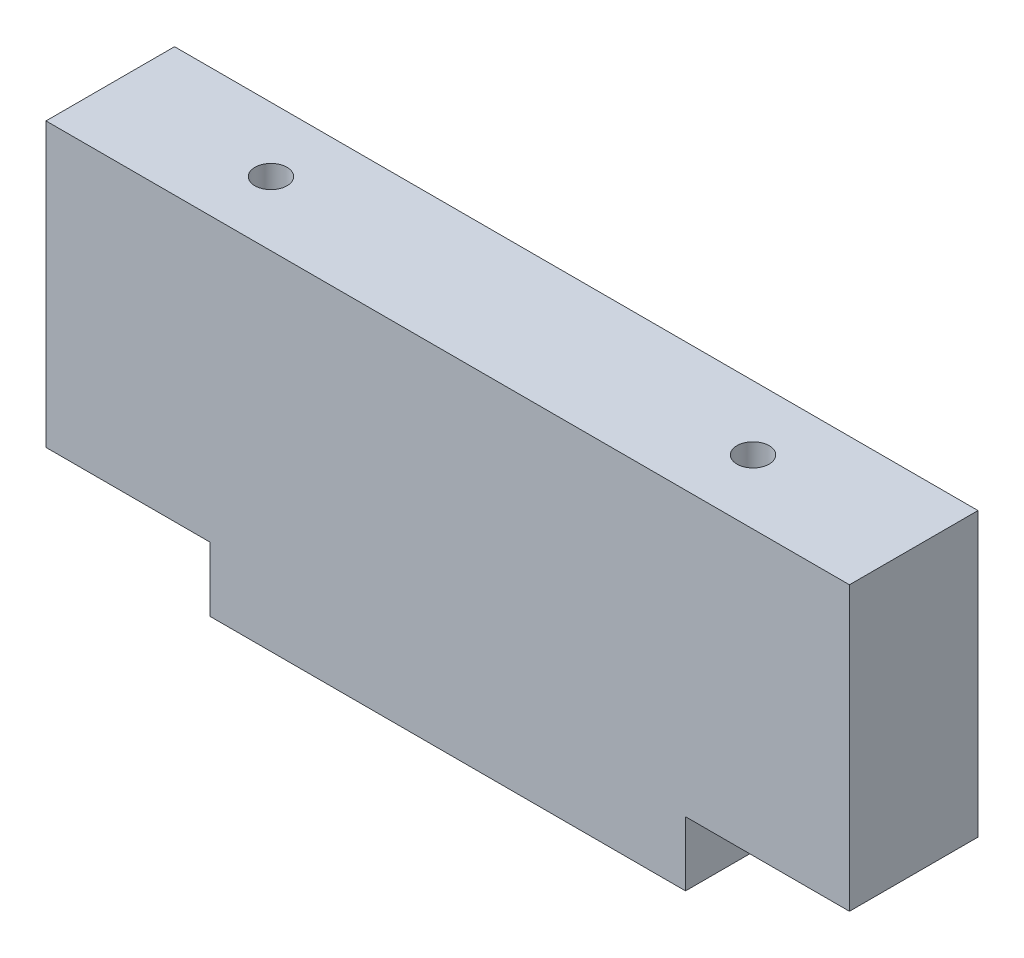
ISO-10303-21;
HEADER;
FILE_DESCRIPTION(('STEP AP214'),'2;1');
FILE_NAME('part.step','',(''),(''),'','','');
FILE_SCHEMA(('AUTOMOTIVE_DESIGN { 1 0 10303 214 1 1 1 1 }'));
ENDSEC;
DATA;
#1=APPLICATION_CONTEXT('core data for automotive mechanical design processes');
#2=APPLICATION_PROTOCOL_DEFINITION('international standard','automotive_design',2000,#1);
#3=PRODUCT_CONTEXT('',#1,'mechanical');
#4=PRODUCT('Part','Part','',(#3));
#5=PRODUCT_RELATED_PRODUCT_CATEGORY('part','',(#4));
#6=PRODUCT_DEFINITION_FORMATION('','',#4);
#7=PRODUCT_DEFINITION_CONTEXT('part definition',#1,'design');
#8=PRODUCT_DEFINITION('design','',#6,#7);
#9=PRODUCT_DEFINITION_SHAPE('','',#8);
#10=(LENGTH_UNIT() NAMED_UNIT(*) SI_UNIT(.MILLI.,.METRE.));
#11=(NAMED_UNIT(*) PLANE_ANGLE_UNIT() SI_UNIT($,.RADIAN.));
#12=(NAMED_UNIT(*) SI_UNIT($,.STERADIAN.) SOLID_ANGLE_UNIT());
#13=UNCERTAINTY_MEASURE_WITH_UNIT(LENGTH_MEASURE(1.E-05),#10,'distance_accuracy_value','');
#14=(GEOMETRIC_REPRESENTATION_CONTEXT(3) GLOBAL_UNCERTAINTY_ASSIGNED_CONTEXT((#13)) GLOBAL_UNIT_ASSIGNED_CONTEXT((#10,
#11,#12)) REPRESENTATION_CONTEXT('',''));
#15=CARTESIAN_POINT('',(0.,0.,0.));
#16=DIRECTION('',(0.,0.,1.));
#17=DIRECTION('',(1.,0.,0.));
#18=AXIS2_PLACEMENT_3D('',#15,#16,#17);
#19=CARTESIAN_POINT('',(-37.,10.,10.));
#20=DIRECTION('',(1.,0.,0.));
#21=DIRECTION('',(0.,0.,-1.));
#22=AXIS2_PLACEMENT_3D('',#19,#20,#21);
#23=PLANE('',#22);
#24=DIRECTION('',(0.,-1.,0.));
#25=VECTOR('',#24,1.);
#26=CARTESIAN_POINT('',(-37.,10.,-10.));
#27=LINE('',#26,#25);
#28=CARTESIAN_POINT('',(-37.,10.,-10.));
#29=VERTEX_POINT('',#28);
#30=CARTESIAN_POINT('',(-37.,0.,-10.));
#31=VERTEX_POINT('',#30);
#32=EDGE_CURVE('E136',#29,#31,#27,.T.);
#33=ORIENTED_EDGE('',*,*,#32,.T.);
#34=DIRECTION('',(0.,0.,-1.));
#35=VECTOR('',#34,1.);
#36=CARTESIAN_POINT('',(-37.,0.,10.));
#37=LINE('',#36,#35);
#38=CARTESIAN_POINT('',(-37.,0.,10.));
#39=VERTEX_POINT('',#38);
#40=EDGE_CURVE('E11',#39,#31,#37,.T.);
#41=ORIENTED_EDGE('',*,*,#40,.F.);
#42=DIRECTION('',(0.,-1.,0.));
#43=VECTOR('',#42,1.);
#44=CARTESIAN_POINT('',(-37.,10.,10.));
#45=LINE('',#44,#43);
#46=CARTESIAN_POINT('',(-37.,10.,10.));
#47=VERTEX_POINT('',#46);
#48=EDGE_CURVE('E151',#47,#39,#45,.T.);
#49=ORIENTED_EDGE('',*,*,#48,.F.);
#50=DIRECTION('',(0.,0.,-1.));
#51=VECTOR('',#50,1.);
#52=CARTESIAN_POINT('',(-37.,10.,10.));
#53=LINE('',#52,#51);
#54=EDGE_CURVE('E132',#47,#29,#53,.T.);
#55=ORIENTED_EDGE('',*,*,#54,.T.);
#56=EDGE_LOOP('',(#33,#41,#49,#55));
#57=FACE_BOUND('',#56,.T.);
#58=ADVANCED_FACE('F37',(#57),#23,.F.);
#59=CARTESIAN_POINT('',(-37.,0.,10.));
#60=DIRECTION('',(0.,1.,0.));
#61=DIRECTION('',(0.,0.,1.));
#62=AXIS2_PLACEMENT_3D('',#59,#60,#61);
#63=PLANE('',#62);
#64=DIRECTION('',(1.,0.,0.));
#65=VECTOR('',#64,1.);
#66=CARTESIAN_POINT('',(-37.,0.,-10.));
#67=LINE('',#66,#65);
#68=CARTESIAN_POINT('',(37.,0.,-10.));
#69=VERTEX_POINT('',#68);
#70=EDGE_CURVE('E139',#31,#69,#67,.T.);
#71=ORIENTED_EDGE('',*,*,#70,.T.);
#72=DIRECTION('',(0.,0.,-1.));
#73=VECTOR('',#72,1.);
#74=CARTESIAN_POINT('',(37.,0.,10.));
#75=LINE('',#74,#73);
#76=CARTESIAN_POINT('',(37.,0.,10.));
#77=VERTEX_POINT('',#76);
#78=EDGE_CURVE('E45',#77,#69,#75,.T.);
#79=ORIENTED_EDGE('',*,*,#78,.F.);
#80=DIRECTION('',(1.,0.,0.));
#81=VECTOR('',#80,1.);
#82=CARTESIAN_POINT('',(-37.,0.,10.));
#83=LINE('',#82,#81);
#84=EDGE_CURVE('E97',#39,#77,#83,.T.);
#85=ORIENTED_EDGE('',*,*,#84,.F.);
#86=ORIENTED_EDGE('',*,*,#40,.T.);
#87=EDGE_LOOP('',(#71,#79,#85,#86));
#88=FACE_BOUND('',#87,.T.);
#89=ADVANCED_FACE('F232',(#88),#63,.F.);
#90=CARTESIAN_POINT('',(37.,0.,10.));
#91=DIRECTION('',(-1.,0.,0.));
#92=DIRECTION('',(0.,0.,1.));
#93=AXIS2_PLACEMENT_3D('',#90,#91,#92);
#94=PLANE('',#93);
#95=DIRECTION('',(0.,1.,0.));
#96=VECTOR('',#95,1.);
#97=CARTESIAN_POINT('',(37.,0.,-10.));
#98=LINE('',#97,#96);
#99=CARTESIAN_POINT('',(37.,10.,-10.));
#100=VERTEX_POINT('',#99);
#101=EDGE_CURVE('E142',#69,#100,#98,.T.);
#102=ORIENTED_EDGE('',*,*,#101,.T.);
#103=DIRECTION('',(0.,0.,-1.));
#104=VECTOR('',#103,1.);
#105=CARTESIAN_POINT('',(37.,10.,10.));
#106=LINE('',#105,#104);
#107=CARTESIAN_POINT('',(37.,10.,10.));
#108=VERTEX_POINT('',#107);
#109=EDGE_CURVE('E158',#108,#100,#106,.T.);
#110=ORIENTED_EDGE('',*,*,#109,.F.);
#111=DIRECTION('',(0.,1.,0.));
#112=VECTOR('',#111,1.);
#113=CARTESIAN_POINT('',(37.,0.,10.));
#114=LINE('',#113,#112);
#115=EDGE_CURVE('E166',#77,#108,#114,.T.);
#116=ORIENTED_EDGE('',*,*,#115,.F.);
#117=ORIENTED_EDGE('',*,*,#78,.T.);
#118=EDGE_LOOP('',(#102,#110,#116,#117));
#119=FACE_BOUND('',#118,.T.);
#120=ADVANCED_FACE('F164',(#119),#94,.F.);
#121=CARTESIAN_POINT('',(37.,10.,10.));
#122=DIRECTION('',(0.,1.,0.));
#123=DIRECTION('',(-1.,0.,0.));
#124=AXIS2_PLACEMENT_3D('',#121,#122,#123);
#125=PLANE('',#124);
#126=CARTESIAN_POINT('',(50.,10.,0.));
#127=DIRECTION('',(0.,-1.,0.));
#128=DIRECTION('',(0.,0.,-1.));
#129=AXIS2_PLACEMENT_3D('',#126,#127,#128);
#130=CIRCLE('',#129,2.49999999999999);
#131=CARTESIAN_POINT('',(50.,10.,-2.49999999999999));
#132=VERTEX_POINT('',#131);
#133=EDGE_CURVE('E186',#132,#132,#130,.T.);
#134=ORIENTED_EDGE('',*,*,#133,.F.);
#135=EDGE_LOOP('',(#134));
#136=FACE_BOUND('',#135,.T.);
#137=DIRECTION('',(1.,0.,0.));
#138=VECTOR('',#137,1.);
#139=CARTESIAN_POINT('',(37.,10.,-10.));
#140=LINE('',#139,#138);
#141=CARTESIAN_POINT('',(62.5,10.,-10.));
#142=VERTEX_POINT('',#141);
#143=EDGE_CURVE('E144',#100,#142,#140,.T.);
#144=ORIENTED_EDGE('',*,*,#143,.T.);
#145=DIRECTION('',(0.,0.,-1.));
#146=VECTOR('',#145,1.);
#147=CARTESIAN_POINT('',(62.5,10.,10.));
#148=LINE('',#147,#146);
#149=CARTESIAN_POINT('',(62.5,10.,10.));
#150=VERTEX_POINT('',#149);
#151=EDGE_CURVE('E155',#150,#142,#148,.T.);
#152=ORIENTED_EDGE('',*,*,#151,.F.);
#153=DIRECTION('',(1.,0.,0.));
#154=VECTOR('',#153,1.);
#155=CARTESIAN_POINT('',(37.,10.,10.));
#156=LINE('',#155,#154);
#157=EDGE_CURVE('E178',#108,#150,#156,.T.);
#158=ORIENTED_EDGE('',*,*,#157,.F.);
#159=ORIENTED_EDGE('',*,*,#109,.T.);
#160=EDGE_LOOP('',(#144,#152,#158,#159));
#161=FACE_BOUND('',#160,.T.);
#162=ADVANCED_FACE('F174',(#136,#161),#125,.F.);
#163=CARTESIAN_POINT('',(62.5,10.,10.));
#164=DIRECTION('',(-1.,0.,0.));
#165=DIRECTION('',(0.,0.,1.));
#166=AXIS2_PLACEMENT_3D('',#163,#164,#165);
#167=PLANE('',#166);
#168=DIRECTION('',(0.,1.,0.));
#169=VECTOR('',#168,1.);
#170=CARTESIAN_POINT('',(62.5,10.,-10.));
#171=LINE('',#170,#169);
#172=CARTESIAN_POINT('',(62.5,54.,-10.));
#173=VERTEX_POINT('',#172);
#174=EDGE_CURVE('E146',#142,#173,#171,.T.);
#175=ORIENTED_EDGE('',*,*,#174,.T.);
#176=DIRECTION('',(0.,0.,-1.));
#177=VECTOR('',#176,1.);
#178=CARTESIAN_POINT('',(62.5,54.,10.));
#179=LINE('',#178,#177);
#180=CARTESIAN_POINT('',(62.5,54.,10.));
#181=VERTEX_POINT('',#180);
#182=EDGE_CURVE('E127',#181,#173,#179,.T.);
#183=ORIENTED_EDGE('',*,*,#182,.F.);
#184=DIRECTION('',(0.,1.,0.));
#185=VECTOR('',#184,1.);
#186=CARTESIAN_POINT('',(62.5,10.,10.));
#187=LINE('',#186,#185);
#188=EDGE_CURVE('E118',#150,#181,#187,.T.);
#189=ORIENTED_EDGE('',*,*,#188,.F.);
#190=ORIENTED_EDGE('',*,*,#151,.T.);
#191=EDGE_LOOP('',(#175,#183,#189,#190));
#192=FACE_BOUND('',#191,.T.);
#193=ADVANCED_FACE('F177',(#192),#167,.F.);
#194=CARTESIAN_POINT('',(62.5,54.,10.));
#195=DIRECTION('',(0.,-1.,0.));
#196=DIRECTION('',(1.,0.,0.));
#197=AXIS2_PLACEMENT_3D('',#194,#195,#196);
#198=PLANE('',#197);
#199=CARTESIAN_POINT('',(-37.5,54.,0.));
#200=DIRECTION('',(0.,1.,0.));
#201=DIRECTION('',(0.,0.,1.));
#202=AXIS2_PLACEMENT_3D('',#199,#200,#201);
#203=CIRCLE('',#202,2.49999999999999);
#204=CARTESIAN_POINT('',(-37.5,54.,2.49999999999999));
#205=VERTEX_POINT('',#204);
#206=EDGE_CURVE('E204',#205,#205,#203,.T.);
#207=ORIENTED_EDGE('',*,*,#206,.F.);
#208=EDGE_LOOP('',(#207));
#209=FACE_BOUND('',#208,.T.);
#210=CARTESIAN_POINT('',(37.5,54.,0.));
#211=DIRECTION('',(0.,1.,0.));
#212=DIRECTION('',(0.,0.,1.));
#213=AXIS2_PLACEMENT_3D('',#210,#211,#212);
#214=CIRCLE('',#213,2.49999999999999);
#215=CARTESIAN_POINT('',(37.5,54.,2.49999999999999));
#216=VERTEX_POINT('',#215);
#217=EDGE_CURVE('E198',#216,#216,#214,.T.);
#218=ORIENTED_EDGE('',*,*,#217,.F.);
#219=EDGE_LOOP('',(#218));
#220=FACE_BOUND('',#219,.T.);
#221=DIRECTION('',(-1.,0.,0.));
#222=VECTOR('',#221,1.);
#223=CARTESIAN_POINT('',(62.5,54.,-10.));
#224=LINE('',#223,#222);
#225=CARTESIAN_POINT('',(-62.5,54.,-10.));
#226=VERTEX_POINT('',#225);
#227=EDGE_CURVE('E126',#173,#226,#224,.T.);
#228=ORIENTED_EDGE('',*,*,#227,.T.);
#229=DIRECTION('',(0.,0.,-1.));
#230=VECTOR('',#229,1.);
#231=CARTESIAN_POINT('',(-62.5,54.,10.));
#232=LINE('',#231,#230);
#233=CARTESIAN_POINT('',(-62.5,54.,10.));
#234=VERTEX_POINT('',#233);
#235=EDGE_CURVE('E123',#234,#226,#232,.T.);
#236=ORIENTED_EDGE('',*,*,#235,.F.);
#237=DIRECTION('',(-1.,0.,0.));
#238=VECTOR('',#237,1.);
#239=CARTESIAN_POINT('',(62.5,54.,10.));
#240=LINE('',#239,#238);
#241=EDGE_CURVE('E112',#181,#234,#240,.T.);
#242=ORIENTED_EDGE('',*,*,#241,.F.);
#243=ORIENTED_EDGE('',*,*,#182,.T.);
#244=EDGE_LOOP('',(#228,#236,#242,#243));
#245=FACE_BOUND('',#244,.T.);
#246=ADVANCED_FACE('F124',(#209,#220,#245),#198,.F.);
#247=CARTESIAN_POINT('',(-62.5,54.,10.));
#248=DIRECTION('',(1.,0.,0.));
#249=DIRECTION('',(0.,1.,0.));
#250=AXIS2_PLACEMENT_3D('',#247,#248,#249);
#251=PLANE('',#250);
#252=DIRECTION('',(0.,-1.,0.));
#253=VECTOR('',#252,1.);
#254=CARTESIAN_POINT('',(-62.5,54.,-10.));
#255=LINE('',#254,#253);
#256=CARTESIAN_POINT('',(-62.5,10.,-10.));
#257=VERTEX_POINT('',#256);
#258=EDGE_CURVE('E83',#226,#257,#255,.T.);
#259=ORIENTED_EDGE('',*,*,#258,.T.);
#260=DIRECTION('',(0.,0.,-1.));
#261=VECTOR('',#260,1.);
#262=CARTESIAN_POINT('',(-62.5,10.,10.));
#263=LINE('',#262,#261);
#264=CARTESIAN_POINT('',(-62.5,10.,10.));
#265=VERTEX_POINT('',#264);
#266=EDGE_CURVE('E128',#265,#257,#263,.T.);
#267=ORIENTED_EDGE('',*,*,#266,.F.);
#268=DIRECTION('',(0.,-1.,0.));
#269=VECTOR('',#268,1.);
#270=CARTESIAN_POINT('',(-62.5,54.,10.));
#271=LINE('',#270,#269);
#272=EDGE_CURVE('E116',#234,#265,#271,.T.);
#273=ORIENTED_EDGE('',*,*,#272,.F.);
#274=ORIENTED_EDGE('',*,*,#235,.T.);
#275=EDGE_LOOP('',(#259,#267,#273,#274));
#276=FACE_BOUND('',#275,.T.);
#277=ADVANCED_FACE('F130',(#276),#251,.F.);
#278=CARTESIAN_POINT('',(-62.5,10.,10.));
#279=DIRECTION('',(0.,1.,0.));
#280=DIRECTION('',(0.,0.,1.));
#281=AXIS2_PLACEMENT_3D('',#278,#279,#280);
#282=PLANE('',#281);
#283=CARTESIAN_POINT('',(-50.,10.,0.));
#284=DIRECTION('',(0.,-1.,0.));
#285=DIRECTION('',(0.,0.,-1.));
#286=AXIS2_PLACEMENT_3D('',#283,#284,#285);
#287=CIRCLE('',#286,2.49999999999999);
#288=CARTESIAN_POINT('',(-50.,10.,-2.49999999999999));
#289=VERTEX_POINT('',#288);
#290=EDGE_CURVE('E192',#289,#289,#287,.T.);
#291=ORIENTED_EDGE('',*,*,#290,.F.);
#292=EDGE_LOOP('',(#291));
#293=FACE_BOUND('',#292,.T.);
#294=DIRECTION('',(1.,0.,0.));
#295=VECTOR('',#294,1.);
#296=CARTESIAN_POINT('',(-62.5,10.,-10.));
#297=LINE('',#296,#295);
#298=EDGE_CURVE('E89',#257,#29,#297,.T.);
#299=ORIENTED_EDGE('',*,*,#298,.T.);
#300=ORIENTED_EDGE('',*,*,#54,.F.);
#301=DIRECTION('',(1.,0.,0.));
#302=VECTOR('',#301,1.);
#303=CARTESIAN_POINT('',(-62.5,10.,10.));
#304=LINE('',#303,#302);
#305=EDGE_CURVE('E53',#265,#47,#304,.T.);
#306=ORIENTED_EDGE('',*,*,#305,.F.);
#307=ORIENTED_EDGE('',*,*,#266,.T.);
#308=EDGE_LOOP('',(#299,#300,#306,#307));
#309=FACE_BOUND('',#308,.T.);
#310=ADVANCED_FACE('F239',(#293,#309),#282,.F.);
#311=CARTESIAN_POINT('',(0.,0.,10.));
#312=DIRECTION('',(0.,0.,1.));
#313=DIRECTION('',(1.,0.,0.));
#314=AXIS2_PLACEMENT_3D('',#311,#312,#313);
#315=PLANE('',#314);
#316=ORIENTED_EDGE('',*,*,#48,.T.);
#317=ORIENTED_EDGE('',*,*,#84,.T.);
#318=ORIENTED_EDGE('',*,*,#115,.T.);
#319=ORIENTED_EDGE('',*,*,#157,.T.);
#320=ORIENTED_EDGE('',*,*,#188,.T.);
#321=ORIENTED_EDGE('',*,*,#241,.T.);
#322=ORIENTED_EDGE('',*,*,#272,.T.);
#323=ORIENTED_EDGE('',*,*,#305,.T.);
#324=EDGE_LOOP('',(#316,#317,#318,#319,#320,#321,#322,#323));
#325=FACE_BOUND('',#324,.T.);
#326=ADVANCED_FACE('F114',(#325),#315,.T.);
#327=CARTESIAN_POINT('',(0.,0.,-10.));
#328=DIRECTION('',(0.,0.,1.));
#329=DIRECTION('',(1.,0.,0.));
#330=AXIS2_PLACEMENT_3D('',#327,#328,#329);
#331=PLANE('',#330);
#332=ORIENTED_EDGE('',*,*,#32,.F.);
#333=ORIENTED_EDGE('',*,*,#298,.F.);
#334=ORIENTED_EDGE('',*,*,#258,.F.);
#335=ORIENTED_EDGE('',*,*,#227,.F.);
#336=ORIENTED_EDGE('',*,*,#174,.F.);
#337=ORIENTED_EDGE('',*,*,#143,.F.);
#338=ORIENTED_EDGE('',*,*,#101,.F.);
#339=ORIENTED_EDGE('',*,*,#70,.F.);
#340=EDGE_LOOP('',(#332,#333,#334,#335,#336,#337,#338,#339));
#341=FACE_BOUND('',#340,.T.);
#342=ADVANCED_FACE('F170',(#341),#331,.F.);
#343=CARTESIAN_POINT('',(50.,25.,0.));
#344=DIRECTION('',(0.,-1.,0.));
#345=DIRECTION('',(0.,0.,-1.));
#346=AXIS2_PLACEMENT_3D('',#343,#344,#345);
#347=CONICAL_SURFACE('',#346,2.49999999999999,1.02974425867665);
#348=CARTESIAN_POINT('',(50.,26.5021515475689,0.));
#349=VERTEX_POINT('',#348);
#350=VERTEX_LOOP('',#349);
#351=FACE_BOUND('',#350,.T.);
#352=CARTESIAN_POINT('',(50.,25.,0.));
#353=DIRECTION('',(0.,-1.,0.));
#354=DIRECTION('',(0.,0.,-1.));
#355=AXIS2_PLACEMENT_3D('',#352,#353,#354);
#356=CIRCLE('',#355,2.49999999999999);
#357=CARTESIAN_POINT('',(50.,25.,-2.49999999999999));
#358=VERTEX_POINT('',#357);
#359=EDGE_CURVE('E140',#358,#358,#356,.T.);
#360=ORIENTED_EDGE('',*,*,#359,.T.);
#361=EDGE_LOOP('',(#360));
#362=FACE_BOUND('',#361,.T.);
#363=ADVANCED_FACE('F295',(#351,#362),#347,.F.);
#364=CARTESIAN_POINT('',(50.,10.,0.));
#365=DIRECTION('',(0.,-1.,0.));
#366=DIRECTION('',(0.,0.,-1.));
#367=AXIS2_PLACEMENT_3D('',#364,#365,#366);
#368=CYLINDRICAL_SURFACE('',#367,2.49999999999999);
#369=ORIENTED_EDGE('',*,*,#359,.F.);
#370=EDGE_LOOP('',(#369));
#371=FACE_BOUND('',#370,.T.);
#372=ORIENTED_EDGE('',*,*,#133,.T.);
#373=EDGE_LOOP('',(#372));
#374=FACE_BOUND('',#373,.T.);
#375=ADVANCED_FACE('F304',(#371,#374),#368,.F.);
#376=CARTESIAN_POINT('',(-50.,25.,0.));
#377=DIRECTION('',(0.,-1.,0.));
#378=DIRECTION('',(0.,0.,-1.));
#379=AXIS2_PLACEMENT_3D('',#376,#377,#378);
#380=CONICAL_SURFACE('',#379,2.49999999999999,1.02974425867665);
#381=CARTESIAN_POINT('',(-50.,26.5021515475689,0.));
#382=VERTEX_POINT('',#381);
#383=VERTEX_LOOP('',#382);
#384=FACE_BOUND('',#383,.T.);
#385=CARTESIAN_POINT('',(-50.,25.,0.));
#386=DIRECTION('',(0.,-1.,0.));
#387=DIRECTION('',(0.,0.,-1.));
#388=AXIS2_PLACEMENT_3D('',#385,#386,#387);
#389=CIRCLE('',#388,2.49999999999999);
#390=CARTESIAN_POINT('',(-50.,25.,-2.49999999999999));
#391=VERTEX_POINT('',#390);
#392=EDGE_CURVE('E189',#391,#391,#389,.T.);
#393=ORIENTED_EDGE('',*,*,#392,.T.);
#394=EDGE_LOOP('',(#393));
#395=FACE_BOUND('',#394,.T.);
#396=ADVANCED_FACE('F312',(#384,#395),#380,.F.);
#397=CARTESIAN_POINT('',(-50.,10.,0.));
#398=DIRECTION('',(0.,-1.,0.));
#399=DIRECTION('',(0.,0.,-1.));
#400=AXIS2_PLACEMENT_3D('',#397,#398,#399);
#401=CYLINDRICAL_SURFACE('',#400,2.49999999999999);
#402=ORIENTED_EDGE('',*,*,#392,.F.);
#403=EDGE_LOOP('',(#402));
#404=FACE_BOUND('',#403,.T.);
#405=ORIENTED_EDGE('',*,*,#290,.T.);
#406=EDGE_LOOP('',(#405));
#407=FACE_BOUND('',#406,.T.);
#408=ADVANCED_FACE('F227',(#404,#407),#401,.F.);
#409=CARTESIAN_POINT('',(37.5,39.,0.));
#410=DIRECTION('',(0.,1.,0.));
#411=DIRECTION('',(0.,0.,1.));
#412=AXIS2_PLACEMENT_3D('',#409,#410,#411);
#413=CONICAL_SURFACE('',#412,2.49999999999999,1.02974425867665);
#414=CARTESIAN_POINT('',(37.5,37.4978484524311,0.));
#415=VERTEX_POINT('',#414);
#416=VERTEX_LOOP('',#415);
#417=FACE_BOUND('',#416,.T.);
#418=CARTESIAN_POINT('',(37.5,39.,0.));
#419=DIRECTION('',(0.,1.,0.));
#420=DIRECTION('',(0.,0.,1.));
#421=AXIS2_PLACEMENT_3D('',#418,#419,#420);
#422=CIRCLE('',#421,2.49999999999999);
#423=CARTESIAN_POINT('',(37.5,39.,2.49999999999999));
#424=VERTEX_POINT('',#423);
#425=EDGE_CURVE('E195',#424,#424,#422,.T.);
#426=ORIENTED_EDGE('',*,*,#425,.T.);
#427=EDGE_LOOP('',(#426));
#428=FACE_BOUND('',#427,.T.);
#429=ADVANCED_FACE('F218',(#417,#428),#413,.F.);
#430=CARTESIAN_POINT('',(37.5,54.,0.));
#431=DIRECTION('',(0.,1.,0.));
#432=DIRECTION('',(0.,0.,1.));
#433=AXIS2_PLACEMENT_3D('',#430,#431,#432);
#434=CYLINDRICAL_SURFACE('',#433,2.49999999999999);
#435=ORIENTED_EDGE('',*,*,#425,.F.);
#436=EDGE_LOOP('',(#435));
#437=FACE_BOUND('',#436,.T.);
#438=ORIENTED_EDGE('',*,*,#217,.T.);
#439=EDGE_LOOP('',(#438));
#440=FACE_BOUND('',#439,.T.);
#441=ADVANCED_FACE('F215',(#437,#440),#434,.F.);
#442=CARTESIAN_POINT('',(-37.5,39.,0.));
#443=DIRECTION('',(0.,1.,0.));
#444=DIRECTION('',(0.,0.,1.));
#445=AXIS2_PLACEMENT_3D('',#442,#443,#444);
#446=CONICAL_SURFACE('',#445,2.49999999999999,1.02974425867665);
#447=CARTESIAN_POINT('',(-37.5,37.4978484524311,0.));
#448=VERTEX_POINT('',#447);
#449=VERTEX_LOOP('',#448);
#450=FACE_BOUND('',#449,.T.);
#451=CARTESIAN_POINT('',(-37.5,39.,0.));
#452=DIRECTION('',(0.,1.,0.));
#453=DIRECTION('',(0.,0.,1.));
#454=AXIS2_PLACEMENT_3D('',#451,#452,#453);
#455=CIRCLE('',#454,2.49999999999999);
#456=CARTESIAN_POINT('',(-37.5,39.,2.49999999999999));
#457=VERTEX_POINT('',#456);
#458=EDGE_CURVE('E201',#457,#457,#455,.T.);
#459=ORIENTED_EDGE('',*,*,#458,.T.);
#460=EDGE_LOOP('',(#459));
#461=FACE_BOUND('',#460,.T.);
#462=ADVANCED_FACE('F217',(#450,#461),#446,.F.);
#463=CARTESIAN_POINT('',(-37.5,54.,0.));
#464=DIRECTION('',(0.,1.,0.));
#465=DIRECTION('',(0.,0.,1.));
#466=AXIS2_PLACEMENT_3D('',#463,#464,#465);
#467=CYLINDRICAL_SURFACE('',#466,2.49999999999999);
#468=ORIENTED_EDGE('',*,*,#458,.F.);
#469=EDGE_LOOP('',(#468));
#470=FACE_BOUND('',#469,.T.);
#471=ORIENTED_EDGE('',*,*,#206,.T.);
#472=EDGE_LOOP('',(#471));
#473=FACE_BOUND('',#472,.T.);
#474=ADVANCED_FACE('F208',(#470,#473),#467,.F.);
#475=CLOSED_SHELL('',(#58,#89,#120,#162,#193,#246,#277,#310,#326,#342,#363,#375,#396,#408,#429,
#441,#462,#474));
#476=MANIFOLD_SOLID_BREP('B2',#475);
#477=ADVANCED_BREP_SHAPE_REPRESENTATION('',(#18,#476),#14);
#478=SHAPE_DEFINITION_REPRESENTATION(#9,#477);
ENDSEC;
END-ISO-10303-21;
